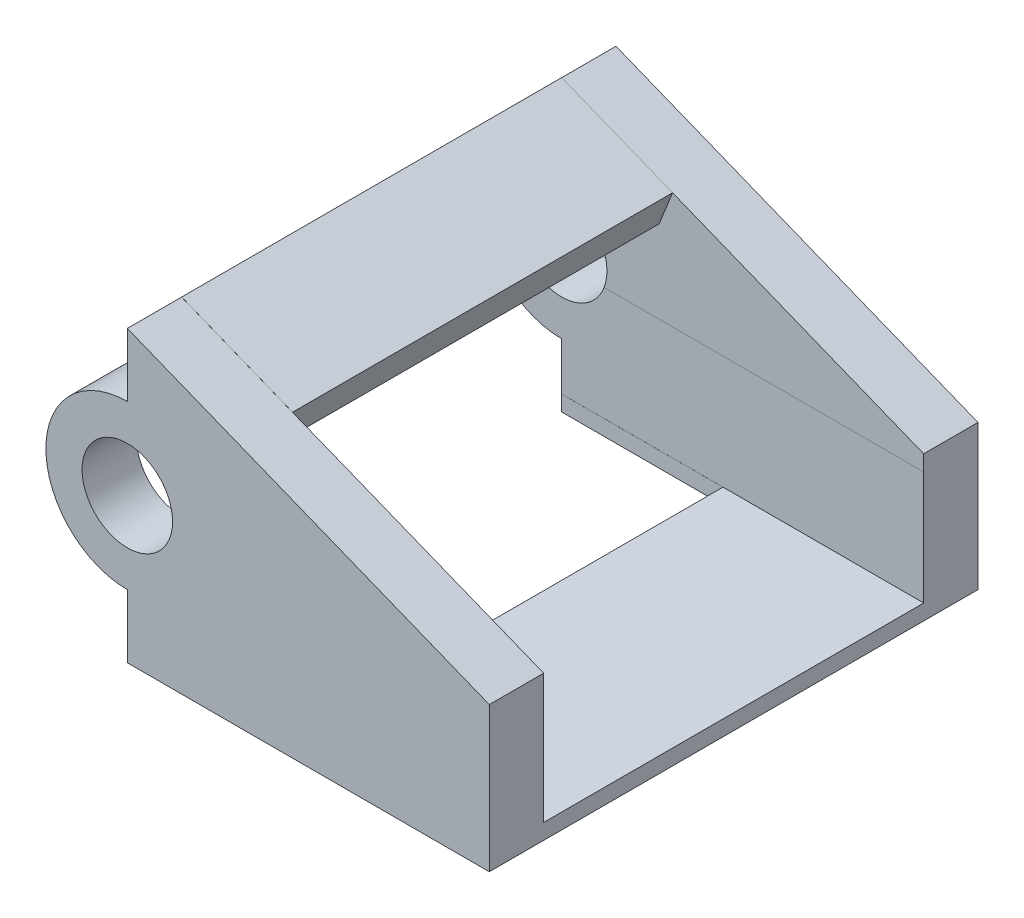
ISO-10303-21;
HEADER;
FILE_DESCRIPTION(('STEP AP214'),'2;1');
FILE_NAME('part.step','',(''),(''),'','','');
FILE_SCHEMA(('AUTOMOTIVE_DESIGN { 1 0 10303 214 1 1 1 1 }'));
ENDSEC;
DATA;
#1=APPLICATION_CONTEXT('core data for automotive mechanical design processes');
#2=APPLICATION_PROTOCOL_DEFINITION('international standard','automotive_design',2000,#1);
#3=PRODUCT_CONTEXT('',#1,'mechanical');
#4=PRODUCT('Part','Part','',(#3));
#5=PRODUCT_RELATED_PRODUCT_CATEGORY('part','',(#4));
#6=PRODUCT_DEFINITION_FORMATION('','',#4);
#7=PRODUCT_DEFINITION_CONTEXT('part definition',#1,'design');
#8=PRODUCT_DEFINITION('design','',#6,#7);
#9=PRODUCT_DEFINITION_SHAPE('','',#8);
#10=(LENGTH_UNIT() NAMED_UNIT(*) SI_UNIT(.MILLI.,.METRE.));
#11=(NAMED_UNIT(*) PLANE_ANGLE_UNIT() SI_UNIT($,.RADIAN.));
#12=(NAMED_UNIT(*) SI_UNIT($,.STERADIAN.) SOLID_ANGLE_UNIT());
#13=UNCERTAINTY_MEASURE_WITH_UNIT(LENGTH_MEASURE(1.E-05),#10,'distance_accuracy_value','');
#14=(GEOMETRIC_REPRESENTATION_CONTEXT(3) GLOBAL_UNCERTAINTY_ASSIGNED_CONTEXT((#13)) GLOBAL_UNIT_ASSIGNED_CONTEXT((#10,
#11,#12)) REPRESENTATION_CONTEXT('',''));
#15=CARTESIAN_POINT('',(0.,0.,0.));
#16=DIRECTION('',(0.,0.,1.));
#17=DIRECTION('',(1.,0.,0.));
#18=AXIS2_PLACEMENT_3D('',#15,#16,#17);
#19=CARTESIAN_POINT('',(1.85957700674856,4.64894251687141,23.9964961968742));
#20=DIRECTION('',(0.,0.,-1.));
#21=DIRECTION('',(-1.,0.,0.));
#22=AXIS2_PLACEMENT_3D('',#19,#20,#21);
#23=PLANE('',#22);
#24=DIRECTION('',(-0.928476690885259,0.371390676354104,0.));
#25=VECTOR('',#24,1.);
#26=CARTESIAN_POINT('',(1.85957700674856,4.64894251687141,23.9964961968742));
#27=LINE('',#26,#25);
#28=CARTESIAN_POINT('',(-3.52821142536398,6.80405788971642,23.9964961968742));
#29=VERTEX_POINT('',#28);
#30=CARTESIAN_POINT('',(-8.91099867182243,8.9571727882998,23.9964961968742));
#31=VERTEX_POINT('',#30);
#32=EDGE_CURVE('E12',#29,#31,#27,.T.);
#33=ORIENTED_EDGE('',*,*,#32,.F.);
#34=DIRECTION('',(0.371390676354104,0.928476690885259,0.));
#35=VECTOR('',#34,1.);
#36=CARTESIAN_POINT('',(-6.49933683619681,-0.623755637365653,23.9964961968742));
#37=LINE('',#36,#35);
#38=CARTESIAN_POINT('',(-2.78543007265577,8.66101127148694,23.9964961968742));
#39=VERTEX_POINT('',#38);
#40=EDGE_CURVE('E91',#29,#39,#37,.T.);
#41=ORIENTED_EDGE('',*,*,#40,.T.);
#42=DIRECTION('',(-0.928476690885259,0.371390676354104,0.));
#43=VECTOR('',#42,1.);
#44=CARTESIAN_POINT('',(2.60235835945677,6.50589589864192,23.9964961968742));
#45=LINE('',#44,#43);
#46=CARTESIAN_POINT('',(-8.91099867182243,11.1112387111536,23.9964961968742));
#47=VERTEX_POINT('',#46);
#48=EDGE_CURVE('E53',#39,#47,#45,.T.);
#49=ORIENTED_EDGE('',*,*,#48,.T.);
#50=DIRECTION('',(0.,-1.,0.));
#51=VECTOR('',#50,1.);
#52=CARTESIAN_POINT('',(-8.91099867182243,4.64894251687141,23.9964961968742));
#53=LINE('',#52,#51);
#54=EDGE_CURVE('E108',#47,#31,#53,.T.);
#55=ORIENTED_EDGE('',*,*,#54,.T.);
#56=EDGE_LOOP('',(#33,#41,#49,#55));
#57=FACE_BOUND('',#56,.T.);
#58=ADVANCED_FACE('F49',(#57),#23,.F.);
#59=CARTESIAN_POINT('',(1.85957700674856,4.64894251687141,3.));
#60=DIRECTION('',(0.,0.,-1.));
#61=DIRECTION('',(-1.,0.,0.));
#62=AXIS2_PLACEMENT_3D('',#59,#60,#61);
#63=PLANE('',#62);
#64=DIRECTION('',(0.371390676354104,0.928476690885259,0.));
#65=VECTOR('',#64,1.);
#66=CARTESIAN_POINT('',(-6.49933683619681,-0.623755637365652,3.));
#67=LINE('',#66,#65);
#68=CARTESIAN_POINT('',(-3.52821142536398,6.80405788971642,3.));
#69=VERTEX_POINT('',#68);
#70=CARTESIAN_POINT('',(-2.78543007265578,8.66101127148694,3.));
#71=VERTEX_POINT('',#70);
#72=EDGE_CURVE('E66',#69,#71,#67,.T.);
#73=ORIENTED_EDGE('',*,*,#72,.F.);
#74=DIRECTION('',(-0.928476690885259,0.371390676354104,0.));
#75=VECTOR('',#74,1.);
#76=CARTESIAN_POINT('',(1.85957700674856,4.64894251687141,3.));
#77=LINE('',#76,#75);
#78=CARTESIAN_POINT('',(-8.91099867182243,8.9571727882998,3.));
#79=VERTEX_POINT('',#78);
#80=EDGE_CURVE('E58',#69,#79,#77,.T.);
#81=ORIENTED_EDGE('',*,*,#80,.T.);
#82=DIRECTION('',(0.,-1.,0.));
#83=VECTOR('',#82,1.);
#84=CARTESIAN_POINT('',(-8.91099867182243,11.1112387111536,3.));
#85=LINE('',#84,#83);
#86=CARTESIAN_POINT('',(-8.91099867182243,11.1112387111536,3.));
#87=VERTEX_POINT('',#86);
#88=EDGE_CURVE('E115',#87,#79,#85,.T.);
#89=ORIENTED_EDGE('',*,*,#88,.F.);
#90=DIRECTION('',(-0.928476690885259,0.371390676354104,0.));
#91=VECTOR('',#90,1.);
#92=CARTESIAN_POINT('',(2.60235835945677,6.50589589864192,3.));
#93=LINE('',#92,#91);
#94=EDGE_CURVE('E104',#71,#87,#93,.T.);
#95=ORIENTED_EDGE('',*,*,#94,.F.);
#96=EDGE_LOOP('',(#73,#81,#89,#95));
#97=FACE_BOUND('',#96,.T.);
#98=ADVANCED_FACE('F51',(#97),#63,.T.);
#99=CARTESIAN_POINT('',(1.85957700674856,4.64894251687141,0.));
#100=DIRECTION('',(0.371390676354104,0.92847669088526,0.));
#101=DIRECTION('',(-0.928476690885259,0.371390676354104,0.));
#102=AXIS2_PLACEMENT_3D('',#99,#100,#101);
#103=PLANE('',#102);
#104=ORIENTED_EDGE('',*,*,#80,.F.);
#105=DIRECTION('',(0.,0.,1.));
#106=VECTOR('',#105,1.);
#107=CARTESIAN_POINT('',(-3.52821142536398,6.80405788971642,0.));
#108=LINE('',#107,#106);
#109=EDGE_CURVE('E97',#69,#29,#108,.T.);
#110=ORIENTED_EDGE('',*,*,#109,.T.);
#111=ORIENTED_EDGE('',*,*,#32,.T.);
#112=DIRECTION('',(0.,0.,-1.));
#113=VECTOR('',#112,1.);
#114=CARTESIAN_POINT('',(-8.91099867182243,8.9571727882998,28.));
#115=LINE('',#114,#113);
#116=EDGE_CURVE('E112',#31,#79,#115,.T.);
#117=ORIENTED_EDGE('',*,*,#116,.T.);
#118=EDGE_LOOP('',(#104,#110,#111,#117));
#119=FACE_BOUND('',#118,.T.);
#120=ADVANCED_FACE('F120',(#119),#103,.F.);
#121=CARTESIAN_POINT('',(2.60235835945677,6.50589589864192,0.));
#122=DIRECTION('',(0.371390676354104,0.92847669088526,0.));
#123=DIRECTION('',(-0.928476690885259,0.371390676354104,0.));
#124=AXIS2_PLACEMENT_3D('',#121,#122,#123);
#125=PLANE('',#124);
#126=DIRECTION('',(0.,0.,1.));
#127=VECTOR('',#126,1.);
#128=CARTESIAN_POINT('',(-2.78543007265577,8.66101127148694,3.));
#129=LINE('',#128,#127);
#130=EDGE_CURVE('E89',#71,#39,#129,.T.);
#131=ORIENTED_EDGE('',*,*,#130,.F.);
#132=ORIENTED_EDGE('',*,*,#94,.T.);
#133=DIRECTION('',(0.,0.,-1.));
#134=VECTOR('',#133,1.);
#135=CARTESIAN_POINT('',(-8.91099867182243,11.1112387111536,0.));
#136=LINE('',#135,#134);
#137=EDGE_CURVE('E102',#47,#87,#136,.T.);
#138=ORIENTED_EDGE('',*,*,#137,.F.);
#139=ORIENTED_EDGE('',*,*,#48,.F.);
#140=EDGE_LOOP('',(#131,#132,#138,#139));
#141=FACE_BOUND('',#140,.T.);
#142=ADVANCED_FACE('F100',(#141),#125,.T.);
#143=CARTESIAN_POINT('',(-8.91099867182243,11.1112387111536,28.));
#144=DIRECTION('',(1.,0.,0.));
#145=DIRECTION('',(0.,0.,-1.));
#146=AXIS2_PLACEMENT_3D('',#143,#144,#145);
#147=PLANE('',#146);
#148=ORIENTED_EDGE('',*,*,#137,.T.);
#149=ORIENTED_EDGE('',*,*,#88,.T.);
#150=ORIENTED_EDGE('',*,*,#116,.F.);
#151=ORIENTED_EDGE('',*,*,#54,.F.);
#152=EDGE_LOOP('',(#148,#149,#150,#151));
#153=FACE_BOUND('',#152,.T.);
#154=ADVANCED_FACE('F123',(#153),#147,.F.);
#155=CARTESIAN_POINT('',(-6.49933683619681,-0.623755637365652,3.));
#156=DIRECTION('',(-0.928476690885259,0.371390676354104,0.));
#157=DIRECTION('',(-0.371390676354104,-0.928476690885259,0.));
#158=AXIS2_PLACEMENT_3D('',#155,#156,#157);
#159=PLANE('',#158);
#160=ORIENTED_EDGE('',*,*,#72,.T.);
#161=ORIENTED_EDGE('',*,*,#130,.T.);
#162=ORIENTED_EDGE('',*,*,#40,.F.);
#163=ORIENTED_EDGE('',*,*,#109,.F.);
#164=EDGE_LOOP('',(#160,#161,#162,#163));
#165=FACE_BOUND('',#164,.T.);
#166=ADVANCED_FACE('F90',(#165),#159,.F.);
#167=CLOSED_SHELL('',(#58,#98,#120,#142,#154,#166));
#168=MANIFOLD_SOLID_BREP('B2',#167);
#169=CARTESIAN_POINT('',(-8.91099867182243,35.1112387111536,18.));
#170=DIRECTION('',(-1.,0.,0.));
#171=DIRECTION('',(0.,0.,1.));
#172=AXIS2_PLACEMENT_3D('',#169,#170,#171);
#173=PLANE('',#172);
#174=DIRECTION('',(0.,-1.,0.));
#175=VECTOR('',#174,1.);
#176=CARTESIAN_POINT('',(-8.91099867182243,35.1112387111536,24.));
#177=LINE('',#176,#175);
#178=CARTESIAN_POINT('',(-8.91099867182243,7.61123871115359,24.));
#179=VERTEX_POINT('',#178);
#180=CARTESIAN_POINT('',(-8.91099867182243,5.61123871115359,24.));
#181=VERTEX_POINT('',#180);
#182=EDGE_CURVE('E591',#179,#181,#177,.T.);
#183=ORIENTED_EDGE('',*,*,#182,.T.);
#184=DIRECTION('',(0.,0.,-1.));
#185=VECTOR('',#184,1.);
#186=CARTESIAN_POINT('',(-8.91099867182243,5.61123871115359,40.));
#187=LINE('',#186,#185);
#188=CARTESIAN_POINT('',(-8.91099867182243,5.61123871115359,23.9964961968742));
#189=VERTEX_POINT('',#188);
#190=EDGE_CURVE('E47',#181,#189,#187,.T.);
#191=ORIENTED_EDGE('',*,*,#190,.T.);
#192=DIRECTION('',(0.,1.,0.));
#193=VECTOR('',#192,1.);
#194=CARTESIAN_POINT('',(-8.91099867182243,0.,23.9964961968742));
#195=LINE('',#194,#193);
#196=CARTESIAN_POINT('',(-8.91099867182243,7.61123871115359,23.9964961968742));
#197=VERTEX_POINT('',#196);
#198=EDGE_CURVE('E327',#189,#197,#195,.T.);
#199=ORIENTED_EDGE('',*,*,#198,.T.);
#200=DIRECTION('',(0.,0.,-1.));
#201=VECTOR('',#200,1.);
#202=CARTESIAN_POINT('',(-8.91099867182243,7.61123871115359,27.));
#203=LINE('',#202,#201);
#204=EDGE_CURVE('E588',#179,#197,#203,.T.);
#205=ORIENTED_EDGE('',*,*,#204,.F.);
#206=EDGE_LOOP('',(#183,#191,#199,#205));
#207=FACE_BOUND('',#206,.T.);
#208=ADVANCED_FACE('F173',(#207),#173,.F.);
#209=CARTESIAN_POINT('',(-28.9109986718224,0.,23.9964961968742));
#210=DIRECTION('',(0.,0.,-1.));
#211=DIRECTION('',(-1.,0.,0.));
#212=AXIS2_PLACEMENT_3D('',#209,#210,#211);
#213=PLANE('',#212);
#214=DIRECTION('',(0.,-1.,0.));
#215=VECTOR('',#214,1.);
#216=CARTESIAN_POINT('',(0.,0.,23.9964961968742));
#217=LINE('',#216,#215);
#218=CARTESIAN_POINT('',(0.,7.54683924242462,23.9964961968742));
#219=VERTEX_POINT('',#218);
#220=CARTESIAN_POINT('',(0.,-4.03024116679873,23.9964961968742));
#221=VERTEX_POINT('',#220);
#222=EDGE_CURVE('E333',#219,#221,#217,.T.);
#223=ORIENTED_EDGE('',*,*,#222,.F.);
#224=DIRECTION('',(-0.92847669088526,0.371390676354104,0.));
#225=VECTOR('',#224,1.);
#226=CARTESIAN_POINT('',(-8.91099867182244,11.1112387111536,23.9964961968742));
#227=LINE('',#226,#225);
#228=CARTESIAN_POINT('',(11.0890013281776,3.11123871115359,23.9964961968742));
#229=VERTEX_POINT('',#228);
#230=EDGE_CURVE('E441',#229,#219,#227,.T.);
#231=ORIENTED_EDGE('',*,*,#230,.F.);
#232=DIRECTION('',(0.,1.,0.));
#233=VECTOR('',#232,1.);
#234=CARTESIAN_POINT('',(11.0890013281776,0.,23.9964961968742));
#235=LINE('',#234,#233);
#236=CARTESIAN_POINT('',(11.0890013281776,-4.03024116679873,23.9964961968742));
#237=VERTEX_POINT('',#236);
#238=EDGE_CURVE('E446',#237,#229,#235,.T.);
#239=ORIENTED_EDGE('',*,*,#238,.F.);
#240=DIRECTION('',(1.,0.,0.));
#241=VECTOR('',#240,1.);
#242=CARTESIAN_POINT('',(-28.9109986718224,-4.03024116679873,23.9964961968742));
#243=LINE('',#242,#241);
#244=EDGE_CURVE('E451',#221,#237,#243,.T.);
#245=ORIENTED_EDGE('',*,*,#244,.F.);
#246=EDGE_LOOP('',(#223,#231,#239,#245));
#247=FACE_BOUND('',#246,.T.);
#248=ADVANCED_FACE('F519',(#247),#213,.T.);
#249=CARTESIAN_POINT('',(-8.91099867182244,3.11123871115359,27.));
#250=DIRECTION('',(0.,0.,-1.));
#251=DIRECTION('',(-1.,0.,0.));
#252=AXIS2_PLACEMENT_3D('',#249,#250,#251);
#253=CYLINDRICAL_SURFACE('',#252,4.5);
#254=DIRECTION('',(0.,0.,-1.));
#255=VECTOR('',#254,1.);
#256=CARTESIAN_POINT('',(-8.91099867182244,7.61123871115359,27.));
#257=LINE('',#256,#255);
#258=CARTESIAN_POINT('',(-8.91099867182244,7.61123871115359,27.));
#259=VERTEX_POINT('',#258);
#260=EDGE_CURVE('E382',#259,#179,#257,.T.);
#261=ORIENTED_EDGE('',*,*,#260,.T.);
#262=ORIENTED_EDGE('',*,*,#204,.T.);
#263=CARTESIAN_POINT('',(-8.91099867182244,3.11123871115359,23.9964961968742));
#264=DIRECTION('',(0.,0.,-1.));
#265=DIRECTION('',(-1.,0.,0.));
#266=AXIS2_PLACEMENT_3D('',#263,#264,#265);
#267=CIRCLE('',#266,4.5);
#268=CARTESIAN_POINT('',(-8.91099867182243,-1.38876128884641,23.9964961968742));
#269=VERTEX_POINT('',#268);
#270=EDGE_CURVE('E453',#269,#197,#267,.T.);
#271=ORIENTED_EDGE('',*,*,#270,.F.);
#272=DIRECTION('',(0.,0.,-1.));
#273=VECTOR('',#272,1.);
#274=CARTESIAN_POINT('',(-8.91099867182243,-1.38876128884641,27.));
#275=LINE('',#274,#273);
#276=CARTESIAN_POINT('',(-8.91099867182243,-1.38876128884641,24.));
#277=VERTEX_POINT('',#276);
#278=EDGE_CURVE('E332',#269,#277,#275,.F.);
#279=ORIENTED_EDGE('',*,*,#278,.T.);
#280=DIRECTION('',(0.,0.,-1.));
#281=VECTOR('',#280,1.);
#282=CARTESIAN_POINT('',(-8.91099867182243,-1.38876128884641,27.));
#283=LINE('',#282,#281);
#284=CARTESIAN_POINT('',(-8.91099867182243,-1.38876128884641,27.));
#285=VERTEX_POINT('',#284);
#286=EDGE_CURVE('E379',#285,#277,#283,.T.);
#287=ORIENTED_EDGE('',*,*,#286,.F.);
#288=CARTESIAN_POINT('',(-8.91099867182244,3.11123871115359,27.));
#289=DIRECTION('',(0.,0.,1.));
#290=DIRECTION('',(1.,0.,0.));
#291=AXIS2_PLACEMENT_3D('',#288,#289,#290);
#292=CIRCLE('',#291,4.5);
#293=EDGE_CURVE('E426',#259,#285,#292,.T.);
#294=ORIENTED_EDGE('',*,*,#293,.F.);
#295=EDGE_LOOP('',(#261,#262,#271,#279,#287,#294));
#296=FACE_BOUND('',#295,.T.);
#297=ADVANCED_FACE('F521',(#296),#253,.T.);
#298=CARTESIAN_POINT('',(11.0890013281776,3.11123871115359,27.));
#299=DIRECTION('',(-1.,0.,0.));
#300=DIRECTION('',(0.,0.,1.));
#301=AXIS2_PLACEMENT_3D('',#298,#299,#300);
#302=PLANE('',#301);
#303=ORIENTED_EDGE('',*,*,#238,.T.);
#304=DIRECTION('',(0.,0.,-1.));
#305=VECTOR('',#304,1.);
#306=CARTESIAN_POINT('',(11.0890013281776,3.11123871115359,27.));
#307=LINE('',#306,#305);
#308=CARTESIAN_POINT('',(11.0890013281776,3.11123871115359,27.));
#309=VERTEX_POINT('',#308);
#310=EDGE_CURVE('E364',#309,#229,#307,.T.);
#311=ORIENTED_EDGE('',*,*,#310,.F.);
#312=DIRECTION('',(0.,1.,0.));
#313=VECTOR('',#312,1.);
#314=CARTESIAN_POINT('',(11.0890013281776,3.11123871115359,27.));
#315=LINE('',#314,#313);
#316=CARTESIAN_POINT('',(11.0890013281776,-4.88876128884641,27.));
#317=VERTEX_POINT('',#316);
#318=EDGE_CURVE('E437',#317,#309,#315,.T.);
#319=ORIENTED_EDGE('',*,*,#318,.F.);
#320=DIRECTION('',(0.,0.,-1.));
#321=VECTOR('',#320,1.);
#322=CARTESIAN_POINT('',(11.0890013281776,-4.88876128884641,27.));
#323=LINE('',#322,#321);
#324=CARTESIAN_POINT('',(11.0890013281776,-4.88876128884641,0.));
#325=VERTEX_POINT('',#324);
#326=EDGE_CURVE('E372',#317,#325,#323,.T.);
#327=ORIENTED_EDGE('',*,*,#326,.T.);
#328=DIRECTION('',(0.,1.,0.));
#329=VECTOR('',#328,1.);
#330=CARTESIAN_POINT('',(11.0890013281776,3.11123871115359,0.));
#331=LINE('',#330,#329);
#332=CARTESIAN_POINT('',(11.0890013281776,3.11123871115359,0.));
#333=VERTEX_POINT('',#332);
#334=EDGE_CURVE('E420',#325,#333,#331,.T.);
#335=ORIENTED_EDGE('',*,*,#334,.T.);
#336=CARTESIAN_POINT('',(11.0890013281776,3.11123871115359,3.));
#337=VERTEX_POINT('',#336);
#338=EDGE_CURVE('E361',#337,#333,#307,.T.);
#339=ORIENTED_EDGE('',*,*,#338,.F.);
#340=DIRECTION('',(0.,-1.,0.));
#341=VECTOR('',#340,1.);
#342=CARTESIAN_POINT('',(11.0890013281776,12.2419441830388,3.));
#343=LINE('',#342,#341);
#344=CARTESIAN_POINT('',(11.0890013281776,2.24194418303881,3.));
#345=VERTEX_POINT('',#344);
#346=EDGE_CURVE('E484',#337,#345,#343,.T.);
#347=ORIENTED_EDGE('',*,*,#346,.T.);
#348=DIRECTION('',(0.,0.999999978334074,0.000208163041005376));
#349=VECTOR('',#348,1.);
#350=CARTESIAN_POINT('',(11.0890013281776,-4.03024116679873,2.99869436279554));
#351=LINE('',#350,#349);
#352=CARTESIAN_POINT('',(11.0890013281776,-4.03024116679873,2.99869436279554));
#353=VERTEX_POINT('',#352);
#354=EDGE_CURVE('E473',#353,#345,#351,.T.);
#355=ORIENTED_EDGE('',*,*,#354,.F.);
#356=DIRECTION('',(0.,0.,1.));
#357=VECTOR('',#356,1.);
#358=CARTESIAN_POINT('',(11.0890013281776,-4.03024116679873,8.));
#359=LINE('',#358,#357);
#360=EDGE_CURVE('E448',#353,#237,#359,.T.);
#361=ORIENTED_EDGE('',*,*,#360,.T.);
#362=EDGE_LOOP('',(#303,#311,#319,#327,#335,#339,#347,#355,#361));
#363=FACE_BOUND('',#362,.T.);
#364=ADVANCED_FACE('F443',(#363),#302,.F.);
#365=CARTESIAN_POINT('',(-8.91099867182243,-3.88876128884641,27.));
#366=DIRECTION('',(1.,0.,0.));
#367=DIRECTION('',(0.,0.,-1.));
#368=AXIS2_PLACEMENT_3D('',#365,#366,#367);
#369=PLANE('',#368);
#370=ORIENTED_EDGE('',*,*,#286,.T.);
#371=CARTESIAN_POINT('',(-8.91099867182243,-4.88876128884641,24.));
#372=VERTEX_POINT('',#371);
#373=EDGE_CURVE('E582',#277,#372,#177,.T.);
#374=ORIENTED_EDGE('',*,*,#373,.T.);
#375=DIRECTION('',(0.,0.,-1.));
#376=VECTOR('',#375,1.);
#377=CARTESIAN_POINT('',(-8.91099867182243,-4.88876128884641,27.));
#378=LINE('',#377,#376);
#379=CARTESIAN_POINT('',(-8.91099867182243,-4.88876128884641,27.));
#380=VERTEX_POINT('',#379);
#381=EDGE_CURVE('E375',#380,#372,#378,.T.);
#382=ORIENTED_EDGE('',*,*,#381,.F.);
#383=DIRECTION('',(0.,-1.,0.));
#384=VECTOR('',#383,1.);
#385=CARTESIAN_POINT('',(-8.91099867182243,-1.38876128884641,27.));
#386=LINE('',#385,#384);
#387=EDGE_CURVE('E429',#285,#380,#386,.T.);
#388=ORIENTED_EDGE('',*,*,#387,.F.);
#389=EDGE_LOOP('',(#370,#374,#382,#388));
#390=FACE_BOUND('',#389,.T.);
#391=ADVANCED_FACE('F560',(#390),#369,.F.);
#392=DIRECTION('',(0.,-1.,0.));
#393=VECTOR('',#392,1.);
#394=CARTESIAN_POINT('',(-8.91099867182243,25.1112387111536,3.));
#395=LINE('',#394,#393);
#396=CARTESIAN_POINT('',(-8.91099867182243,-4.03024116679873,3.));
#397=VERTEX_POINT('',#396);
#398=CARTESIAN_POINT('',(-8.91099867182243,-4.88876128884641,3.));
#399=VERTEX_POINT('',#398);
#400=EDGE_CURVE('E465',#397,#399,#395,.T.);
#401=ORIENTED_EDGE('',*,*,#400,.F.);
#402=DIRECTION('',(0.,0.,1.));
#403=VECTOR('',#402,1.);
#404=CARTESIAN_POINT('',(-8.91099867182243,-4.03024116679873,27.));
#405=LINE('',#404,#403);
#406=CARTESIAN_POINT('',(-8.91099867182243,-4.03024116679873,2.99869436279554));
#407=VERTEX_POINT('',#406);
#408=EDGE_CURVE('E407',#407,#397,#405,.T.);
#409=ORIENTED_EDGE('',*,*,#408,.F.);
#410=DIRECTION('',(0.,0.999999978334074,0.000208163041005376));
#411=VECTOR('',#410,1.);
#412=CARTESIAN_POINT('',(-8.91099867182243,-3.8837651103157,2.99872485369756));
#413=LINE('',#412,#411);
#414=CARTESIAN_POINT('',(-8.91099867182243,-1.38876128884641,2.9992442212916));
#415=VERTEX_POINT('',#414);
#416=EDGE_CURVE('E479',#407,#415,#413,.T.);
#417=ORIENTED_EDGE('',*,*,#416,.T.);
#418=CARTESIAN_POINT('',(-8.91099867182243,-1.38876128884641,0.));
#419=VERTEX_POINT('',#418);
#420=EDGE_CURVE('E378',#415,#419,#283,.T.);
#421=ORIENTED_EDGE('',*,*,#420,.T.);
#422=DIRECTION('',(0.,-1.,0.));
#423=VECTOR('',#422,1.);
#424=CARTESIAN_POINT('',(-8.91099867182243,-3.88876128884641,0.));
#425=LINE('',#424,#423);
#426=CARTESIAN_POINT('',(-8.91099867182243,-4.88876128884641,0.));
#427=VERTEX_POINT('',#426);
#428=EDGE_CURVE('E413',#419,#427,#425,.T.);
#429=ORIENTED_EDGE('',*,*,#428,.T.);
#430=EDGE_CURVE('E374',#399,#427,#378,.T.);
#431=ORIENTED_EDGE('',*,*,#430,.F.);
#432=EDGE_LOOP('',(#401,#409,#417,#421,#429,#431));
#433=FACE_BOUND('',#432,.T.);
#434=ADVANCED_FACE('F501',(#433),#369,.F.);
#435=CARTESIAN_POINT('',(-8.91099867182243,-4.88876128884641,27.));
#436=DIRECTION('',(0.,1.,0.));
#437=DIRECTION('',(0.,0.,1.));
#438=AXIS2_PLACEMENT_3D('',#435,#436,#437);
#439=PLANE('',#438);
#440=DIRECTION('',(-1.,0.,0.));
#441=VECTOR('',#440,1.);
#442=CARTESIAN_POINT('',(0.,-4.88876128884641,24.));
#443=LINE('',#442,#441);
#444=CARTESIAN_POINT('',(0.,-4.88876128884641,24.));
#445=VERTEX_POINT('',#444);
#446=EDGE_CURVE('E579',#445,#372,#443,.T.);
#447=ORIENTED_EDGE('',*,*,#446,.F.);
#448=DIRECTION('',(0.,0.,1.));
#449=VECTOR('',#448,1.);
#450=CARTESIAN_POINT('',(0.,-4.88876128884641,0.));
#451=LINE('',#450,#449);
#452=CARTESIAN_POINT('',(0.,-4.88876128884641,3.));
#453=VERTEX_POINT('',#452);
#454=EDGE_CURVE('E462',#453,#445,#451,.T.);
#455=ORIENTED_EDGE('',*,*,#454,.F.);
#456=DIRECTION('',(-1.,0.,0.));
#457=VECTOR('',#456,1.);
#458=CARTESIAN_POINT('',(0.,-4.88876128884641,3.));
#459=LINE('',#458,#457);
#460=EDGE_CURVE('E459',#453,#399,#459,.T.);
#461=ORIENTED_EDGE('',*,*,#460,.T.);
#462=ORIENTED_EDGE('',*,*,#430,.T.);
#463=DIRECTION('',(1.,0.,0.));
#464=VECTOR('',#463,1.);
#465=CARTESIAN_POINT('',(-8.91099867182243,-4.88876128884641,0.));
#466=LINE('',#465,#464);
#467=EDGE_CURVE('E415',#427,#325,#466,.T.);
#468=ORIENTED_EDGE('',*,*,#467,.T.);
#469=ORIENTED_EDGE('',*,*,#326,.F.);
#470=DIRECTION('',(1.,0.,0.));
#471=VECTOR('',#470,1.);
#472=CARTESIAN_POINT('',(-8.91099867182243,-4.88876128884641,27.));
#473=LINE('',#472,#471);
#474=EDGE_CURVE('E435',#380,#317,#473,.T.);
#475=ORIENTED_EDGE('',*,*,#474,.F.);
#476=ORIENTED_EDGE('',*,*,#381,.T.);
#477=EDGE_LOOP('',(#447,#455,#461,#462,#468,#469,#475,#476));
#478=FACE_BOUND('',#477,.T.);
#479=ADVANCED_FACE('F509',(#478),#439,.F.);
#480=CARTESIAN_POINT('',(-18.9109986718224,-4.03024116679873,8.));
#481=DIRECTION('',(0.,1.,0.));
#482=DIRECTION('',(0.,0.,1.));
#483=AXIS2_PLACEMENT_3D('',#480,#481,#482);
#484=PLANE('',#483);
#485=DIRECTION('',(0.,0.,-1.));
#486=VECTOR('',#485,1.);
#487=CARTESIAN_POINT('',(0.,-4.03024116679873,8.));
#488=LINE('',#487,#486);
#489=CARTESIAN_POINT('',(0.,-4.03024116679873,3.));
#490=VERTEX_POINT('',#489);
#491=EDGE_CURVE('E467',#221,#490,#488,.T.);
#492=ORIENTED_EDGE('',*,*,#491,.F.);
#493=ORIENTED_EDGE('',*,*,#244,.T.);
#494=ORIENTED_EDGE('',*,*,#360,.F.);
#495=DIRECTION('',(1.,0.,0.));
#496=VECTOR('',#495,1.);
#497=CARTESIAN_POINT('',(-18.9109986718224,-4.03024116679873,2.99869436279554));
#498=LINE('',#497,#496);
#499=EDGE_CURVE('E476',#407,#353,#498,.T.);
#500=ORIENTED_EDGE('',*,*,#499,.F.);
#501=ORIENTED_EDGE('',*,*,#408,.T.);
#502=DIRECTION('',(1.,0.,0.));
#503=VECTOR('',#502,1.);
#504=CARTESIAN_POINT('',(-18.9109986718224,-4.03024116679873,3.));
#505=LINE('',#504,#503);
#506=EDGE_CURVE('E470',#397,#490,#505,.T.);
#507=ORIENTED_EDGE('',*,*,#506,.T.);
#508=EDGE_LOOP('',(#492,#493,#494,#500,#501,#507));
#509=FACE_BOUND('',#508,.T.);
#510=ADVANCED_FACE('F497',(#509),#484,.T.);
#511=CARTESIAN_POINT('',(-8.91099867182244,10.1112387111536,27.));
#512=DIRECTION('',(1.,0.,0.));
#513=DIRECTION('',(0.,0.,-1.));
#514=AXIS2_PLACEMENT_3D('',#511,#512,#513);
#515=PLANE('',#514);
#516=DIRECTION('',(0.,0.,-1.));
#517=VECTOR('',#516,1.);
#518=CARTESIAN_POINT('',(-8.91099867182244,11.1112387111536,27.));
#519=LINE('',#518,#517);
#520=CARTESIAN_POINT('',(-8.91099867182244,11.1112387111536,27.));
#521=VERTEX_POINT('',#520);
#522=CARTESIAN_POINT('',(-8.91099867182244,11.1112387111536,24.));
#523=VERTEX_POINT('',#522);
#524=EDGE_CURVE('E349',#521,#523,#519,.T.);
#525=ORIENTED_EDGE('',*,*,#524,.T.);
#526=EDGE_CURVE('E358',#523,#179,#177,.T.);
#527=ORIENTED_EDGE('',*,*,#526,.T.);
#528=ORIENTED_EDGE('',*,*,#260,.F.);
#529=DIRECTION('',(0.,-1.,0.));
#530=VECTOR('',#529,1.);
#531=CARTESIAN_POINT('',(-8.91099867182244,11.1112387111536,27.));
#532=LINE('',#531,#530);
#533=EDGE_CURVE('E360',#521,#259,#532,.T.);
#534=ORIENTED_EDGE('',*,*,#533,.F.);
#535=EDGE_LOOP('',(#525,#527,#528,#534));
#536=FACE_BOUND('',#535,.T.);
#537=ADVANCED_FACE('F175',(#536),#515,.F.);
#538=DIRECTION('',(0.,-1.,0.));
#539=VECTOR('',#538,1.);
#540=CARTESIAN_POINT('',(-8.91099867182244,10.1112387111536,3.));
#541=LINE('',#540,#539);
#542=CARTESIAN_POINT('',(-8.91099867182244,11.1112387111536,3.));
#543=VERTEX_POINT('',#542);
#544=CARTESIAN_POINT('',(-8.91099867182244,7.61123871115359,3.));
#545=VERTEX_POINT('',#544);
#546=EDGE_CURVE('E492',#543,#545,#541,.T.);
#547=ORIENTED_EDGE('',*,*,#546,.F.);
#548=CARTESIAN_POINT('',(-8.91099867182244,11.1112387111536,0.));
#549=VERTEX_POINT('',#548);
#550=EDGE_CURVE('E362',#543,#549,#519,.T.);
#551=ORIENTED_EDGE('',*,*,#550,.T.);
#552=DIRECTION('',(0.,-1.,0.));
#553=VECTOR('',#552,1.);
#554=CARTESIAN_POINT('',(-8.91099867182244,10.1112387111536,0.));
#555=LINE('',#554,#553);
#556=CARTESIAN_POINT('',(-8.91099867182244,7.61123871115359,0.));
#557=VERTEX_POINT('',#556);
#558=EDGE_CURVE('E401',#549,#557,#555,.T.);
#559=ORIENTED_EDGE('',*,*,#558,.T.);
#560=EDGE_CURVE('E381',#545,#557,#257,.T.);
#561=ORIENTED_EDGE('',*,*,#560,.F.);
#562=EDGE_LOOP('',(#547,#551,#559,#561));
#563=FACE_BOUND('',#562,.T.);
#564=ADVANCED_FACE('F402',(#563),#515,.F.);
#565=CARTESIAN_POINT('',(-8.91099867182244,11.1112387111536,27.));
#566=DIRECTION('',(-0.371390676354104,-0.928476690885259,0.));
#567=DIRECTION('',(0.92847669088526,-0.371390676354104,0.));
#568=AXIS2_PLACEMENT_3D('',#565,#566,#567);
#569=PLANE('',#568);
#570=ORIENTED_EDGE('',*,*,#230,.T.);
#571=DIRECTION('',(0.,0.,1.));
#572=VECTOR('',#571,1.);
#573=CARTESIAN_POINT('',(0.,7.54683924242462,27.));
#574=LINE('',#573,#572);
#575=CARTESIAN_POINT('',(0.,7.54683924242462,24.));
#576=VERTEX_POINT('',#575);
#577=EDGE_CURVE('E351',#219,#576,#574,.T.);
#578=ORIENTED_EDGE('',*,*,#577,.T.);
#579=DIRECTION('',(-0.92847669088526,0.371390676354104,0.));
#580=VECTOR('',#579,1.);
#581=CARTESIAN_POINT('',(-8.91099867182244,11.1112387111536,24.));
#582=LINE('',#581,#580);
#583=EDGE_CURVE('E319',#576,#523,#582,.T.);
#584=ORIENTED_EDGE('',*,*,#583,.T.);
#585=ORIENTED_EDGE('',*,*,#524,.F.);
#586=DIRECTION('',(-0.928476690885259,0.371390676354104,0.));
#587=VECTOR('',#586,1.);
#588=CARTESIAN_POINT('',(-8.91099867182244,11.1112387111536,27.));
#589=LINE('',#588,#587);
#590=EDGE_CURVE('E366',#309,#521,#589,.T.);
#591=ORIENTED_EDGE('',*,*,#590,.F.);
#592=ORIENTED_EDGE('',*,*,#310,.T.);
#593=EDGE_LOOP('',(#570,#578,#584,#585,#591,#592));
#594=FACE_BOUND('',#593,.T.);
#595=ADVANCED_FACE('F347',(#594),#569,.F.);
#596=DIRECTION('',(-0.92847669088526,0.371390676354104,0.));
#597=VECTOR('',#596,1.);
#598=CARTESIAN_POINT('',(-8.91099867182244,11.1112387111536,3.));
#599=LINE('',#598,#597);
#600=EDGE_CURVE('E337',#337,#543,#599,.T.);
#601=ORIENTED_EDGE('',*,*,#600,.F.);
#602=ORIENTED_EDGE('',*,*,#338,.T.);
#603=DIRECTION('',(-0.928476690885259,0.371390676354104,0.));
#604=VECTOR('',#603,1.);
#605=CARTESIAN_POINT('',(-8.91099867182244,11.1112387111536,0.));
#606=LINE('',#605,#604);
#607=EDGE_CURVE('E368',#333,#549,#606,.T.);
#608=ORIENTED_EDGE('',*,*,#607,.T.);
#609=ORIENTED_EDGE('',*,*,#550,.F.);
#610=EDGE_LOOP('',(#601,#602,#608,#609));
#611=FACE_BOUND('',#610,.T.);
#612=ADVANCED_FACE('F557',(#611),#569,.F.);
#613=ORIENTED_EDGE('',*,*,#420,.F.);
#614=CARTESIAN_POINT('',(-8.91099867182244,3.11123871115359,3.00018095499642));
#615=DIRECTION('',(0.,0.000208163041005376,-0.999999978334074));
#616=DIRECTION('',(0.,-0.999999978334074,-0.000208163041005376));
#617=AXIS2_PLACEMENT_3D('',#614,#615,#616);
#618=ELLIPSE('',#617,4.50000009749667,4.5);
#619=CARTESIAN_POINT('',(-13.3262367201489,2.24194418303881,3.));
#620=VERTEX_POINT('',#619);
#621=EDGE_CURVE('E482',#415,#620,#618,.T.);
#622=ORIENTED_EDGE('',*,*,#621,.T.);
#623=CARTESIAN_POINT('',(-8.91099867182244,3.11123871115359,3.));
#624=DIRECTION('',(0.,0.,1.));
#625=DIRECTION('',(1.,0.,0.));
#626=AXIS2_PLACEMENT_3D('',#623,#624,#625);
#627=CIRCLE('',#626,4.5);
#628=EDGE_CURVE('E397',#545,#620,#627,.T.);
#629=ORIENTED_EDGE('',*,*,#628,.F.);
#630=ORIENTED_EDGE('',*,*,#560,.T.);
#631=CARTESIAN_POINT('',(-8.91099867182244,3.11123871115359,0.));
#632=DIRECTION('',(0.,0.,1.));
#633=DIRECTION('',(1.,0.,0.));
#634=AXIS2_PLACEMENT_3D('',#631,#632,#633);
#635=CIRCLE('',#634,4.5);
#636=EDGE_CURVE('E394',#557,#419,#635,.T.);
#637=ORIENTED_EDGE('',*,*,#636,.T.);
#638=EDGE_LOOP('',(#613,#622,#629,#630,#637));
#639=FACE_BOUND('',#638,.T.);
#640=ADVANCED_FACE('F392',(#639),#253,.T.);
#641=CARTESIAN_POINT('',(-8.91099867182244,3.11123871115359,27.));
#642=DIRECTION('',(0.,0.,1.));
#643=DIRECTION('',(1.,0.,0.));
#644=AXIS2_PLACEMENT_3D('',#641,#642,#643);
#645=PLANE('',#644);
#646=CARTESIAN_POINT('',(-8.91099867182244,3.11123871115359,27.));
#647=DIRECTION('',(0.,0.,1.));
#648=DIRECTION('',(1.,0.,0.));
#649=AXIS2_PLACEMENT_3D('',#646,#647,#648);
#650=CIRCLE('',#649,2.5);
#651=CARTESIAN_POINT('',(-6.41099867182244,3.11123871115359,27.));
#652=VERTEX_POINT('',#651);
#653=EDGE_CURVE('E573',#652,#652,#650,.T.);
#654=ORIENTED_EDGE('',*,*,#653,.F.);
#655=EDGE_LOOP('',(#654));
#656=FACE_BOUND('',#655,.T.);
#657=ORIENTED_EDGE('',*,*,#533,.T.);
#658=ORIENTED_EDGE('',*,*,#293,.T.);
#659=ORIENTED_EDGE('',*,*,#387,.T.);
#660=ORIENTED_EDGE('',*,*,#474,.T.);
#661=ORIENTED_EDGE('',*,*,#318,.T.);
#662=ORIENTED_EDGE('',*,*,#590,.T.);
#663=EDGE_LOOP('',(#657,#658,#659,#660,#661,#662));
#664=FACE_BOUND('',#663,.T.);
#665=ADVANCED_FACE('F438',(#656,#664),#645,.T.);
#666=CARTESIAN_POINT('',(-8.91099867182244,3.11123871115359,0.));
#667=DIRECTION('',(0.,0.,1.));
#668=DIRECTION('',(1.,0.,0.));
#669=AXIS2_PLACEMENT_3D('',#666,#667,#668);
#670=PLANE('',#669);
#671=CARTESIAN_POINT('',(-8.91099867182244,3.11123871115359,0.));
#672=DIRECTION('',(0.,0.,-1.));
#673=DIRECTION('',(-1.,0.,0.));
#674=AXIS2_PLACEMENT_3D('',#671,#672,#673);
#675=CIRCLE('',#674,2.5);
#676=CARTESIAN_POINT('',(-11.4109986718224,3.11123871115359,0.));
#677=VERTEX_POINT('',#676);
#678=EDGE_CURVE('E596',#677,#677,#675,.T.);
#679=ORIENTED_EDGE('',*,*,#678,.F.);
#680=EDGE_LOOP('',(#679));
#681=FACE_BOUND('',#680,.T.);
#682=ORIENTED_EDGE('',*,*,#558,.F.);
#683=ORIENTED_EDGE('',*,*,#607,.F.);
#684=ORIENTED_EDGE('',*,*,#334,.F.);
#685=ORIENTED_EDGE('',*,*,#467,.F.);
#686=ORIENTED_EDGE('',*,*,#428,.F.);
#687=ORIENTED_EDGE('',*,*,#636,.F.);
#688=EDGE_LOOP('',(#682,#683,#684,#685,#686,#687));
#689=FACE_BOUND('',#688,.T.);
#690=ADVANCED_FACE('F410',(#681,#689),#670,.F.);
#691=CARTESIAN_POINT('',(-18.9109986718224,12.2419441830388,3.));
#692=DIRECTION('',(0.,0.,1.));
#693=DIRECTION('',(1.,0.,0.));
#694=AXIS2_PLACEMENT_3D('',#691,#692,#693);
#695=PLANE('',#694);
#696=DIRECTION('',(1.,0.,0.));
#697=VECTOR('',#696,1.);
#698=CARTESIAN_POINT('',(-18.9109986718224,2.24194418303881,3.));
#699=LINE('',#698,#697);
#700=CARTESIAN_POINT('',(-6.56700058662917,2.24194418303881,3.));
#701=VERTEX_POINT('',#700);
#702=EDGE_CURVE('E488',#701,#345,#699,.T.);
#703=ORIENTED_EDGE('',*,*,#702,.T.);
#704=ORIENTED_EDGE('',*,*,#346,.F.);
#705=ORIENTED_EDGE('',*,*,#600,.T.);
#706=ORIENTED_EDGE('',*,*,#546,.T.);
#707=ORIENTED_EDGE('',*,*,#628,.T.);
#708=CARTESIAN_POINT('',(-11.2549967570157,2.24194418303881,3.));
#709=VERTEX_POINT('',#708);
#710=EDGE_CURVE('E489',#620,#709,#699,.T.);
#711=ORIENTED_EDGE('',*,*,#710,.T.);
#712=CARTESIAN_POINT('',(-8.91099867182244,3.11123871115359,3.));
#713=DIRECTION('',(0.,0.,1.));
#714=DIRECTION('',(1.,0.,0.));
#715=AXIS2_PLACEMENT_3D('',#712,#713,#714);
#716=CIRCLE('',#715,2.5);
#717=EDGE_CURVE('E187',#701,#709,#716,.T.);
#718=ORIENTED_EDGE('',*,*,#717,.F.);
#719=EDGE_LOOP('',(#703,#704,#705,#706,#707,#711,#718));
#720=FACE_BOUND('',#719,.T.);
#721=ADVANCED_FACE('F544',(#720),#695,.T.);
#722=CARTESIAN_POINT('',(-18.9109986718224,-4.03024116679873,2.99869436279554));
#723=DIRECTION('',(0.,0.000208163041005376,-0.999999978334074));
#724=DIRECTION('',(0.,0.999999978334074,0.000208163041005376));
#725=AXIS2_PLACEMENT_3D('',#722,#723,#724);
#726=PLANE('',#725);
#727=ORIENTED_EDGE('',*,*,#702,.F.);
#728=CARTESIAN_POINT('',(-8.91099867182244,3.11123871115359,3.00018095499642));
#729=DIRECTION('',(0.,0.000208163041005376,-0.999999978334074));
#730=DIRECTION('',(0.,-0.999999978334074,-0.000208163041005376));
#731=AXIS2_PLACEMENT_3D('',#728,#729,#730);
#732=ELLIPSE('',#731,2.50000005416482,2.5);
#733=EDGE_CURVE('E328',#701,#709,#732,.T.);
#734=ORIENTED_EDGE('',*,*,#733,.T.);
#735=ORIENTED_EDGE('',*,*,#710,.F.);
#736=ORIENTED_EDGE('',*,*,#621,.F.);
#737=ORIENTED_EDGE('',*,*,#416,.F.);
#738=ORIENTED_EDGE('',*,*,#499,.T.);
#739=ORIENTED_EDGE('',*,*,#354,.T.);
#740=EDGE_LOOP('',(#727,#734,#735,#736,#737,#738,#739));
#741=FACE_BOUND('',#740,.T.);
#742=ADVANCED_FACE('F505',(#741),#726,.F.);
#743=CARTESIAN_POINT('',(0.,25.1112387111536,3.));
#744=DIRECTION('',(0.,0.,1.));
#745=DIRECTION('',(1.,0.,0.));
#746=AXIS2_PLACEMENT_3D('',#743,#744,#745);
#747=PLANE('',#746);
#748=ORIENTED_EDGE('',*,*,#400,.T.);
#749=ORIENTED_EDGE('',*,*,#460,.F.);
#750=DIRECTION('',(0.,-1.,0.));
#751=VECTOR('',#750,1.);
#752=CARTESIAN_POINT('',(0.,25.1112387111536,3.));
#753=LINE('',#752,#751);
#754=EDGE_CURVE('E464',#490,#453,#753,.T.);
#755=ORIENTED_EDGE('',*,*,#754,.F.);
#756=ORIENTED_EDGE('',*,*,#506,.F.);
#757=EDGE_LOOP('',(#748,#749,#755,#756));
#758=FACE_BOUND('',#757,.T.);
#759=ADVANCED_FACE('F515',(#758),#747,.T.);
#760=CARTESIAN_POINT('',(0.,25.1112387111536,0.));
#761=DIRECTION('',(1.,0.,0.));
#762=DIRECTION('',(0.,0.,-1.));
#763=AXIS2_PLACEMENT_3D('',#760,#761,#762);
#764=PLANE('',#763);
#765=ORIENTED_EDGE('',*,*,#491,.T.);
#766=ORIENTED_EDGE('',*,*,#754,.T.);
#767=ORIENTED_EDGE('',*,*,#454,.T.);
#768=DIRECTION('',(0.,-1.,0.));
#769=VECTOR('',#768,1.);
#770=CARTESIAN_POINT('',(0.,35.1112387111536,24.));
#771=LINE('',#770,#769);
#772=EDGE_CURVE('E581',#576,#445,#771,.T.);
#773=ORIENTED_EDGE('',*,*,#772,.F.);
#774=ORIENTED_EDGE('',*,*,#577,.F.);
#775=ORIENTED_EDGE('',*,*,#222,.T.);
#776=EDGE_LOOP('',(#765,#766,#767,#773,#774,#775));
#777=FACE_BOUND('',#776,.T.);
#778=ADVANCED_FACE('F517',(#777),#764,.F.);
#779=CARTESIAN_POINT('',(-8.91099867182244,3.11123871115359,23.9964961968742));
#780=DIRECTION('',(0.,0.,-1.));
#781=DIRECTION('',(-1.,0.,0.));
#782=AXIS2_PLACEMENT_3D('',#779,#780,#781);
#783=CIRCLE('',#782,2.5);
#784=CARTESIAN_POINT('',(-8.91099867182243,0.611238711153591,23.9964961968742));
#785=VERTEX_POINT('',#784);
#786=EDGE_CURVE('E315',#785,#189,#783,.T.);
#787=ORIENTED_EDGE('',*,*,#786,.F.);
#788=EDGE_CURVE('E325',#269,#785,#195,.T.);
#789=ORIENTED_EDGE('',*,*,#788,.F.);
#790=ORIENTED_EDGE('',*,*,#270,.T.);
#791=ORIENTED_EDGE('',*,*,#198,.F.);
#792=EDGE_LOOP('',(#787,#789,#790,#791));
#793=FACE_BOUND('',#792,.T.);
#794=ADVANCED_FACE('F323',(#793),#213,.T.);
#795=CARTESIAN_POINT('',(0.,35.1112387111536,24.));
#796=DIRECTION('',(0.,0.,1.));
#797=DIRECTION('',(1.,0.,0.));
#798=AXIS2_PLACEMENT_3D('',#795,#796,#797);
#799=PLANE('',#798);
#800=CARTESIAN_POINT('',(-8.91099867182243,0.611238711153588,24.));
#801=VERTEX_POINT('',#800);
#802=EDGE_CURVE('E585',#801,#277,#177,.T.);
#803=ORIENTED_EDGE('',*,*,#802,.F.);
#804=CARTESIAN_POINT('',(-8.91099867182244,3.11123871115359,24.));
#805=DIRECTION('',(0.,0.,1.));
#806=DIRECTION('',(1.,0.,0.));
#807=AXIS2_PLACEMENT_3D('',#804,#805,#806);
#808=CIRCLE('',#807,2.5);
#809=EDGE_CURVE('E195',#801,#181,#808,.T.);
#810=ORIENTED_EDGE('',*,*,#809,.T.);
#811=ORIENTED_EDGE('',*,*,#182,.F.);
#812=ORIENTED_EDGE('',*,*,#526,.F.);
#813=ORIENTED_EDGE('',*,*,#583,.F.);
#814=ORIENTED_EDGE('',*,*,#772,.T.);
#815=ORIENTED_EDGE('',*,*,#446,.T.);
#816=ORIENTED_EDGE('',*,*,#373,.F.);
#817=EDGE_LOOP('',(#803,#810,#811,#812,#813,#814,#815,#816));
#818=FACE_BOUND('',#817,.T.);
#819=ADVANCED_FACE('F532',(#818),#799,.F.);
#820=ORIENTED_EDGE('',*,*,#788,.T.);
#821=DIRECTION('',(0.,0.,-1.));
#822=VECTOR('',#821,1.);
#823=CARTESIAN_POINT('',(-8.91099867182243,0.611238711153591,40.));
#824=LINE('',#823,#822);
#825=EDGE_CURVE('E181',#785,#801,#824,.F.);
#826=ORIENTED_EDGE('',*,*,#825,.T.);
#827=ORIENTED_EDGE('',*,*,#802,.T.);
#828=ORIENTED_EDGE('',*,*,#278,.F.);
#829=EDGE_LOOP('',(#820,#826,#827,#828));
#830=FACE_BOUND('',#829,.T.);
#831=ADVANCED_FACE('F330',(#830),#173,.F.);
#832=CARTESIAN_POINT('',(-8.91099867182244,3.11123871115359,40.));
#833=DIRECTION('',(0.,0.,-1.));
#834=DIRECTION('',(-1.,0.,0.));
#835=AXIS2_PLACEMENT_3D('',#832,#833,#834);
#836=CYLINDRICAL_SURFACE('',#835,2.5);
#837=ORIENTED_EDGE('',*,*,#653,.T.);
#838=EDGE_LOOP('',(#837));
#839=FACE_BOUND('',#838,.T.);
#840=ORIENTED_EDGE('',*,*,#809,.F.);
#841=ORIENTED_EDGE('',*,*,#825,.F.);
#842=ORIENTED_EDGE('',*,*,#786,.T.);
#843=ORIENTED_EDGE('',*,*,#190,.F.);
#844=EDGE_LOOP('',(#840,#841,#842,#843));
#845=FACE_BOUND('',#844,.T.);
#846=ADVANCED_FACE('F314',(#839,#845),#836,.F.);
#847=ORIENTED_EDGE('',*,*,#717,.T.);
#848=ORIENTED_EDGE('',*,*,#733,.F.);
#849=EDGE_LOOP('',(#847,#848));
#850=FACE_BOUND('',#849,.T.);
#851=ORIENTED_EDGE('',*,*,#678,.T.);
#852=EDGE_LOOP('',(#851));
#853=FACE_BOUND('',#852,.T.);
#854=ADVANCED_FACE('F601',(#850,#853),#836,.F.);
#855=CLOSED_SHELL('',(#208,#248,#297,#364,#391,#434,#479,#510,#537,#564,#595,#612,#640,#665,
#690,#721,#742,#759,#778,#794,#819,#831,#846,#854));
#856=MANIFOLD_SOLID_BREP('B6',#855);
#857=ADVANCED_BREP_SHAPE_REPRESENTATION('',(#18,#168,#856),#14);
#858=SHAPE_DEFINITION_REPRESENTATION(#9,#857);
ENDSEC;
END-ISO-10303-21;
